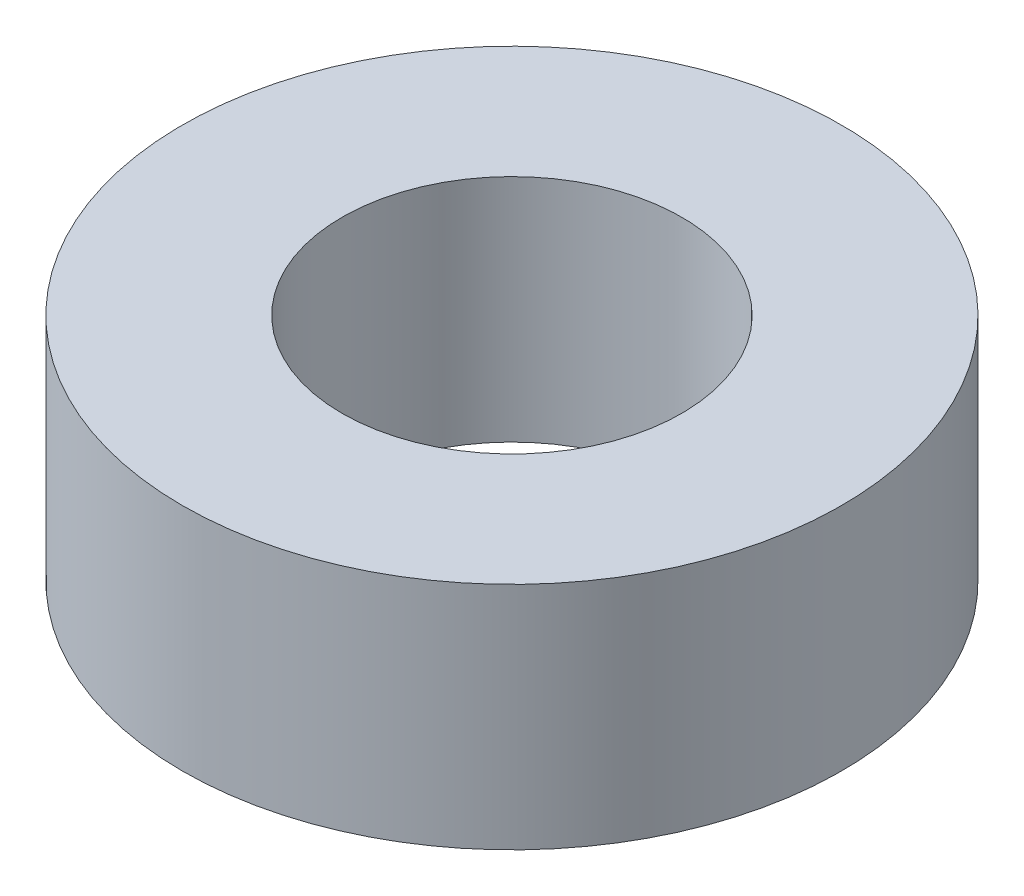
ISO-10303-21;
HEADER;
FILE_DESCRIPTION(('STEP AP214'),'2;1');
FILE_NAME('part.step','',(''),(''),'','','');
FILE_SCHEMA(('AUTOMOTIVE_DESIGN { 1 0 10303 214 1 1 1 1 }'));
ENDSEC;
DATA;
#1=APPLICATION_CONTEXT('core data for automotive mechanical design processes');
#2=APPLICATION_PROTOCOL_DEFINITION('international standard','automotive_design',2000,#1);
#3=PRODUCT_CONTEXT('',#1,'mechanical');
#4=PRODUCT('Part','Part','',(#3));
#5=PRODUCT_RELATED_PRODUCT_CATEGORY('part','',(#4));
#6=PRODUCT_DEFINITION_FORMATION('','',#4);
#7=PRODUCT_DEFINITION_CONTEXT('part definition',#1,'design');
#8=PRODUCT_DEFINITION('design','',#6,#7);
#9=PRODUCT_DEFINITION_SHAPE('','',#8);
#10=(LENGTH_UNIT() NAMED_UNIT(*) SI_UNIT(.MILLI.,.METRE.));
#11=(NAMED_UNIT(*) PLANE_ANGLE_UNIT() SI_UNIT($,.RADIAN.));
#12=(NAMED_UNIT(*) SI_UNIT($,.STERADIAN.) SOLID_ANGLE_UNIT());
#13=UNCERTAINTY_MEASURE_WITH_UNIT(LENGTH_MEASURE(1.E-05),#10,'distance_accuracy_value','');
#14=(GEOMETRIC_REPRESENTATION_CONTEXT(3) GLOBAL_UNCERTAINTY_ASSIGNED_CONTEXT((#13)) GLOBAL_UNIT_ASSIGNED_CONTEXT((#10,
#11,#12)) REPRESENTATION_CONTEXT('',''));
#15=CARTESIAN_POINT('',(0.,0.,0.));
#16=DIRECTION('',(0.,0.,1.));
#17=DIRECTION('',(1.,0.,0.));
#18=AXIS2_PLACEMENT_3D('',#15,#16,#17);
#19=CARTESIAN_POINT('',(0.,4.572,0.));
#20=DIRECTION('',(0.,1.,0.));
#21=DIRECTION('',(0.,0.,1.));
#22=AXIS2_PLACEMENT_3D('',#19,#20,#21);
#23=PLANE('',#22);
#24=CARTESIAN_POINT('',(0.,4.572,0.));
#25=DIRECTION('',(0.,1.,0.));
#26=DIRECTION('',(0.,0.,1.));
#27=AXIS2_PLACEMENT_3D('',#24,#25,#26);
#28=CIRCLE('',#27,6.5532);
#29=CARTESIAN_POINT('',(0.,4.572,6.5532));
#30=VERTEX_POINT('',#29);
#31=EDGE_CURVE('E10',#30,#30,#28,.T.);
#32=ORIENTED_EDGE('',*,*,#31,.T.);
#33=EDGE_LOOP('',(#32));
#34=FACE_BOUND('',#33,.T.);
#35=CARTESIAN_POINT('',(0.,4.572,0.));
#36=DIRECTION('',(0.,1.,0.));
#37=DIRECTION('',(0.,0.,1.));
#38=AXIS2_PLACEMENT_3D('',#35,#36,#37);
#39=CIRCLE('',#38,3.3782);
#40=CARTESIAN_POINT('',(0.,4.572,3.3782));
#41=VERTEX_POINT('',#40);
#42=EDGE_CURVE('E52',#41,#41,#39,.T.);
#43=ORIENTED_EDGE('',*,*,#42,.F.);
#44=EDGE_LOOP('',(#43));
#45=FACE_BOUND('',#44,.T.);
#46=ADVANCED_FACE('F41',(#34,#45),#23,.T.);
#47=CARTESIAN_POINT('',(0.,0.,0.));
#48=DIRECTION('',(0.,1.,0.));
#49=DIRECTION('',(0.,0.,1.));
#50=AXIS2_PLACEMENT_3D('',#47,#48,#49);
#51=PLANE('',#50);
#52=CARTESIAN_POINT('',(0.,0.,0.));
#53=DIRECTION('',(0.,1.,0.));
#54=DIRECTION('',(0.,0.,1.));
#55=AXIS2_PLACEMENT_3D('',#52,#53,#54);
#56=CIRCLE('',#55,6.5532);
#57=CARTESIAN_POINT('',(0.,0.,6.5532));
#58=VERTEX_POINT('',#57);
#59=EDGE_CURVE('E45',#58,#58,#56,.T.);
#60=ORIENTED_EDGE('',*,*,#59,.F.);
#61=EDGE_LOOP('',(#60));
#62=FACE_BOUND('',#61,.T.);
#63=CARTESIAN_POINT('',(0.,0.,0.));
#64=DIRECTION('',(0.,1.,0.));
#65=DIRECTION('',(0.,0.,1.));
#66=AXIS2_PLACEMENT_3D('',#63,#64,#65);
#67=CIRCLE('',#66,3.3782);
#68=CARTESIAN_POINT('',(0.,0.,3.3782));
#69=VERTEX_POINT('',#68);
#70=EDGE_CURVE('E54',#69,#69,#67,.T.);
#71=ORIENTED_EDGE('',*,*,#70,.T.);
#72=EDGE_LOOP('',(#71));
#73=FACE_BOUND('',#72,.T.);
#74=ADVANCED_FACE('F64',(#62,#73),#51,.F.);
#75=CARTESIAN_POINT('',(0.,4.572,0.));
#76=DIRECTION('',(0.,-1.,0.));
#77=DIRECTION('',(0.,0.,-1.));
#78=AXIS2_PLACEMENT_3D('',#75,#76,#77);
#79=CYLINDRICAL_SURFACE('',#78,6.5532);
#80=ORIENTED_EDGE('',*,*,#31,.F.);
#81=EDGE_LOOP('',(#80));
#82=FACE_BOUND('',#81,.T.);
#83=ORIENTED_EDGE('',*,*,#59,.T.);
#84=EDGE_LOOP('',(#83));
#85=FACE_BOUND('',#84,.T.);
#86=ADVANCED_FACE('F43',(#82,#85),#79,.T.);
#87=CARTESIAN_POINT('',(0.,4.572,0.));
#88=DIRECTION('',(0.,-1.,0.));
#89=DIRECTION('',(0.,0.,-1.));
#90=AXIS2_PLACEMENT_3D('',#87,#88,#89);
#91=CYLINDRICAL_SURFACE('',#90,3.3782);
#92=ORIENTED_EDGE('',*,*,#42,.T.);
#93=EDGE_LOOP('',(#92));
#94=FACE_BOUND('',#93,.T.);
#95=ORIENTED_EDGE('',*,*,#70,.F.);
#96=EDGE_LOOP('',(#95));
#97=FACE_BOUND('',#96,.T.);
#98=ADVANCED_FACE('F60',(#94,#97),#91,.F.);
#99=CLOSED_SHELL('',(#46,#74,#86,#98));
#100=MANIFOLD_SOLID_BREP('B2',#99);
#101=ADVANCED_BREP_SHAPE_REPRESENTATION('',(#18,#100),#14);
#102=SHAPE_DEFINITION_REPRESENTATION(#9,#101);
ENDSEC;
END-ISO-10303-21;
